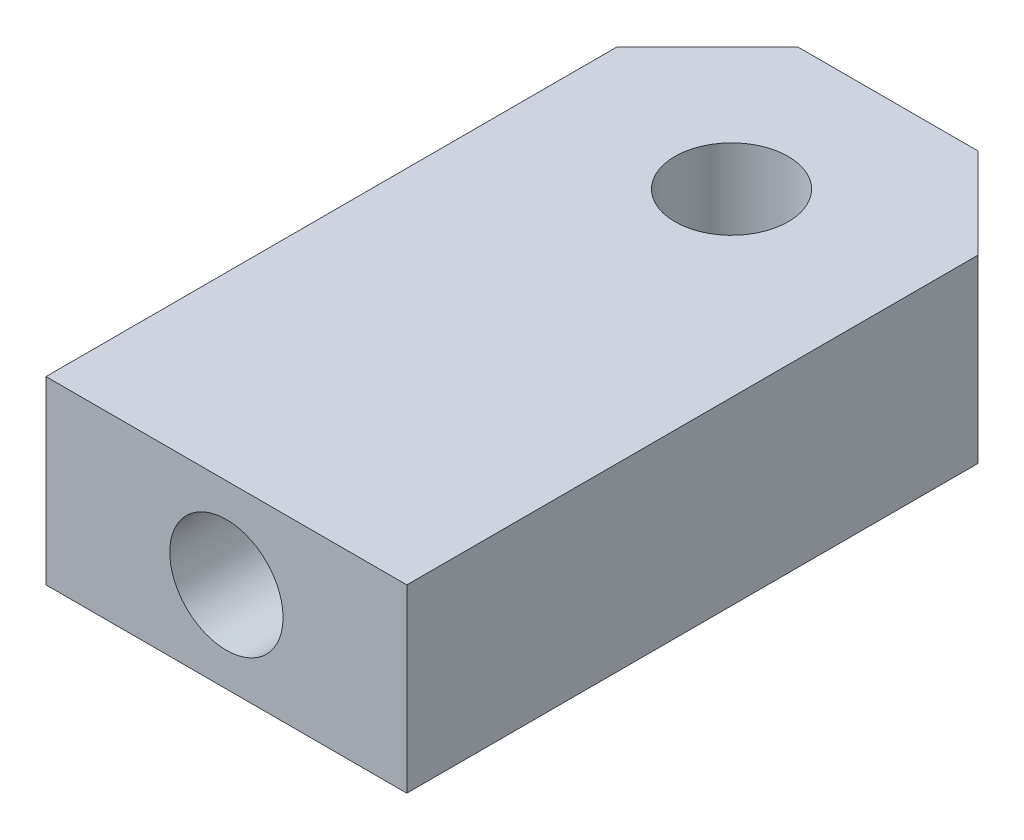
ISO-10303-21;
HEADER;
FILE_DESCRIPTION(('STEP AP214'),'2;1');
FILE_NAME('part.step','',(''),(''),'','','');
FILE_SCHEMA(('AUTOMOTIVE_DESIGN { 1 0 10303 214 1 1 1 1 }'));
ENDSEC;
DATA;
#1=APPLICATION_CONTEXT('core data for automotive mechanical design processes');
#2=APPLICATION_PROTOCOL_DEFINITION('international standard','automotive_design',2000,#1);
#3=PRODUCT_CONTEXT('',#1,'mechanical');
#4=PRODUCT('Part','Part','',(#3));
#5=PRODUCT_RELATED_PRODUCT_CATEGORY('part','',(#4));
#6=PRODUCT_DEFINITION_FORMATION('','',#4);
#7=PRODUCT_DEFINITION_CONTEXT('part definition',#1,'design');
#8=PRODUCT_DEFINITION('design','',#6,#7);
#9=PRODUCT_DEFINITION_SHAPE('','',#8);
#10=(LENGTH_UNIT() NAMED_UNIT(*) SI_UNIT(.MILLI.,.METRE.));
#11=(NAMED_UNIT(*) PLANE_ANGLE_UNIT() SI_UNIT($,.RADIAN.));
#12=(NAMED_UNIT(*) SI_UNIT($,.STERADIAN.) SOLID_ANGLE_UNIT());
#13=UNCERTAINTY_MEASURE_WITH_UNIT(LENGTH_MEASURE(1.E-05),#10,'distance_accuracy_value','');
#14=(GEOMETRIC_REPRESENTATION_CONTEXT(3) GLOBAL_UNCERTAINTY_ASSIGNED_CONTEXT((#13)) GLOBAL_UNIT_ASSIGNED_CONTEXT((#10,
#11,#12)) REPRESENTATION_CONTEXT('',''));
#15=CARTESIAN_POINT('',(0.,0.,0.));
#16=DIRECTION('',(0.,0.,1.));
#17=DIRECTION('',(1.,0.,0.));
#18=AXIS2_PLACEMENT_3D('',#15,#16,#17);
#19=CARTESIAN_POINT('',(5.,5.,0.));
#20=DIRECTION('',(-1.,0.,0.));
#21=DIRECTION('',(0.,0.,1.));
#22=AXIS2_PLACEMENT_3D('',#19,#20,#21);
#23=PLANE('',#22);
#24=DIRECTION('',(0.,0.,-1.));
#25=VECTOR('',#24,1.);
#26=CARTESIAN_POINT('',(5.,0.,0.));
#27=LINE('',#26,#25);
#28=CARTESIAN_POINT('',(5.,0.,14.));
#29=VERTEX_POINT('',#28);
#30=CARTESIAN_POINT('',(5.00000000000001,0.,-1.83012701892217));
#31=VERTEX_POINT('',#30);
#32=EDGE_CURVE('E122',#29,#31,#27,.T.);
#33=ORIENTED_EDGE('',*,*,#32,.T.);
#34=DIRECTION('',(0.,-1.,0.));
#35=VECTOR('',#34,1.);
#36=CARTESIAN_POINT('',(5.00000000000001,5.,-1.83012701892217));
#37=LINE('',#36,#35);
#38=CARTESIAN_POINT('',(5.00000000000001,5.,-1.83012701892217));
#39=VERTEX_POINT('',#38);
#40=EDGE_CURVE('E11',#39,#31,#37,.T.);
#41=ORIENTED_EDGE('',*,*,#40,.F.);
#42=DIRECTION('',(0.,0.,-1.));
#43=VECTOR('',#42,1.);
#44=CARTESIAN_POINT('',(5.,5.,0.));
#45=LINE('',#44,#43);
#46=CARTESIAN_POINT('',(5.,5.,14.));
#47=VERTEX_POINT('',#46);
#48=EDGE_CURVE('E84',#47,#39,#45,.T.);
#49=ORIENTED_EDGE('',*,*,#48,.F.);
#50=DIRECTION('',(0.,-1.,0.));
#51=VECTOR('',#50,1.);
#52=CARTESIAN_POINT('',(5.,5.,14.));
#53=LINE('',#52,#51);
#54=EDGE_CURVE('E118',#47,#29,#53,.T.);
#55=ORIENTED_EDGE('',*,*,#54,.T.);
#56=EDGE_LOOP('',(#33,#41,#49,#55));
#57=FACE_BOUND('',#56,.T.);
#58=ADVANCED_FACE('F34',(#57),#23,.F.);
#59=CARTESIAN_POINT('',(3.4150635094611,5.,-3.41506350946108));
#60=DIRECTION('',(0.707106781186549,0.,-0.707106781186546));
#61=DIRECTION('',(-0.707106781186546,0.,-0.707106781186549));
#62=AXIS2_PLACEMENT_3D('',#59,#60,#61);
#63=PLANE('',#62);
#64=DIRECTION('',(0.707106781186546,0.,0.707106781186549));
#65=VECTOR('',#64,1.);
#66=CARTESIAN_POINT('',(3.4150635094611,0.,-3.41506350946108));
#67=LINE('',#66,#65);
#68=CARTESIAN_POINT('',(2.49999999999998,0.,-4.33012701892221));
#69=VERTEX_POINT('',#68);
#70=EDGE_CURVE('E126',#69,#31,#67,.T.);
#71=ORIENTED_EDGE('',*,*,#70,.F.);
#72=DIRECTION('',(0.,-1.,0.));
#73=VECTOR('',#72,1.);
#74=CARTESIAN_POINT('',(2.49999999999998,5.,-4.33012701892221));
#75=LINE('',#74,#73);
#76=CARTESIAN_POINT('',(2.49999999999998,5.,-4.33012701892221));
#77=VERTEX_POINT('',#76);
#78=EDGE_CURVE('E43',#77,#69,#75,.T.);
#79=ORIENTED_EDGE('',*,*,#78,.F.);
#80=DIRECTION('',(0.707106781186546,0.,0.707106781186549));
#81=VECTOR('',#80,1.);
#82=CARTESIAN_POINT('',(3.4150635094611,5.,-3.41506350946108));
#83=LINE('',#82,#81);
#84=EDGE_CURVE('E113',#77,#39,#83,.T.);
#85=ORIENTED_EDGE('',*,*,#84,.T.);
#86=ORIENTED_EDGE('',*,*,#40,.T.);
#87=EDGE_LOOP('',(#71,#79,#85,#86));
#88=FACE_BOUND('',#87,.T.);
#89=ADVANCED_FACE('F144',(#88),#63,.T.);
#90=CARTESIAN_POINT('',(0.,5.,-4.33012701892221));
#91=DIRECTION('',(0.,0.,-1.));
#92=DIRECTION('',(-1.,0.,0.));
#93=AXIS2_PLACEMENT_3D('',#90,#91,#92);
#94=PLANE('',#93);
#95=DIRECTION('',(1.,0.,0.));
#96=VECTOR('',#95,1.);
#97=CARTESIAN_POINT('',(0.,0.,-4.33012701892221));
#98=LINE('',#97,#96);
#99=CARTESIAN_POINT('',(-2.49999999999997,0.,-4.33012701892221));
#100=VERTEX_POINT('',#99);
#101=EDGE_CURVE('E129',#100,#69,#98,.T.);
#102=ORIENTED_EDGE('',*,*,#101,.F.);
#103=DIRECTION('',(0.,-1.,0.));
#104=VECTOR('',#103,1.);
#105=CARTESIAN_POINT('',(-2.49999999999997,5.,-4.33012701892221));
#106=LINE('',#105,#104);
#107=CARTESIAN_POINT('',(-2.49999999999997,5.,-4.33012701892221));
#108=VERTEX_POINT('',#107);
#109=EDGE_CURVE('E102',#108,#100,#106,.T.);
#110=ORIENTED_EDGE('',*,*,#109,.F.);
#111=DIRECTION('',(1.,0.,0.));
#112=VECTOR('',#111,1.);
#113=CARTESIAN_POINT('',(0.,5.,-4.33012701892221));
#114=LINE('',#113,#112);
#115=EDGE_CURVE('E111',#108,#77,#114,.T.);
#116=ORIENTED_EDGE('',*,*,#115,.T.);
#117=ORIENTED_EDGE('',*,*,#78,.T.);
#118=EDGE_LOOP('',(#102,#110,#116,#117));
#119=FACE_BOUND('',#118,.T.);
#120=ADVANCED_FACE('F141',(#119),#94,.T.);
#121=CARTESIAN_POINT('',(-3.4150635094611,5.,-3.41506350946108));
#122=DIRECTION('',(-0.70710678118655,0.,-0.707106781186545));
#123=DIRECTION('',(-0.707106781186545,0.,0.70710678118655));
#124=AXIS2_PLACEMENT_3D('',#121,#122,#123);
#125=PLANE('',#124);
#126=DIRECTION('',(0.707106781186545,0.,-0.70710678118655));
#127=VECTOR('',#126,1.);
#128=CARTESIAN_POINT('',(-3.4150635094611,0.,-3.41506350946108));
#129=LINE('',#128,#127);
#130=CARTESIAN_POINT('',(-5.,0.,-1.83012701892217));
#131=VERTEX_POINT('',#130);
#132=EDGE_CURVE('E101',#131,#100,#129,.T.);
#133=ORIENTED_EDGE('',*,*,#132,.F.);
#134=DIRECTION('',(0.,-1.,0.));
#135=VECTOR('',#134,1.);
#136=CARTESIAN_POINT('',(-5.,5.,-1.83012701892217));
#137=LINE('',#136,#135);
#138=CARTESIAN_POINT('',(-5.,5.,-1.83012701892217));
#139=VERTEX_POINT('',#138);
#140=EDGE_CURVE('E95',#139,#131,#137,.T.);
#141=ORIENTED_EDGE('',*,*,#140,.F.);
#142=DIRECTION('',(0.707106781186545,0.,-0.70710678118655));
#143=VECTOR('',#142,1.);
#144=CARTESIAN_POINT('',(-3.4150635094611,5.,-3.41506350946108));
#145=LINE('',#144,#143);
#146=EDGE_CURVE('E99',#139,#108,#145,.T.);
#147=ORIENTED_EDGE('',*,*,#146,.T.);
#148=ORIENTED_EDGE('',*,*,#109,.T.);
#149=EDGE_LOOP('',(#133,#141,#147,#148));
#150=FACE_BOUND('',#149,.T.);
#151=ADVANCED_FACE('F97',(#150),#125,.T.);
#152=CARTESIAN_POINT('',(-5.,5.,0.));
#153=DIRECTION('',(1.,0.,0.));
#154=DIRECTION('',(0.,0.,-1.));
#155=AXIS2_PLACEMENT_3D('',#152,#153,#154);
#156=PLANE('',#155);
#157=DIRECTION('',(0.,0.,1.));
#158=VECTOR('',#157,1.);
#159=CARTESIAN_POINT('',(-5.,0.,0.));
#160=LINE('',#159,#158);
#161=CARTESIAN_POINT('',(-5.,0.,14.));
#162=VERTEX_POINT('',#161);
#163=EDGE_CURVE('E72',#131,#162,#160,.T.);
#164=ORIENTED_EDGE('',*,*,#163,.T.);
#165=DIRECTION('',(0.,-1.,0.));
#166=VECTOR('',#165,1.);
#167=CARTESIAN_POINT('',(-5.,5.,14.));
#168=LINE('',#167,#166);
#169=CARTESIAN_POINT('',(-5.,5.,14.));
#170=VERTEX_POINT('',#169);
#171=EDGE_CURVE('E103',#170,#162,#168,.T.);
#172=ORIENTED_EDGE('',*,*,#171,.F.);
#173=DIRECTION('',(0.,0.,1.));
#174=VECTOR('',#173,1.);
#175=CARTESIAN_POINT('',(-5.,5.,0.));
#176=LINE('',#175,#174);
#177=EDGE_CURVE('E105',#139,#170,#176,.T.);
#178=ORIENTED_EDGE('',*,*,#177,.F.);
#179=ORIENTED_EDGE('',*,*,#140,.T.);
#180=EDGE_LOOP('',(#164,#172,#178,#179));
#181=FACE_BOUND('',#180,.T.);
#182=ADVANCED_FACE('F106',(#181),#156,.F.);
#183=CARTESIAN_POINT('',(0.,5.,0.));
#184=DIRECTION('',(0.,-1.,0.));
#185=DIRECTION('',(0.,0.,-1.));
#186=AXIS2_PLACEMENT_3D('',#183,#184,#185);
#187=CYLINDRICAL_SURFACE('',#186,1.57);
#188=CARTESIAN_POINT('',(0.,5.,0.));
#189=DIRECTION('',(0.,1.,0.));
#190=DIRECTION('',(0.,0.,1.));
#191=AXIS2_PLACEMENT_3D('',#188,#189,#190);
#192=CIRCLE('',#191,1.57);
#193=CARTESIAN_POINT('',(0.,5.,1.57));
#194=VERTEX_POINT('',#193);
#195=EDGE_CURVE('E135',#194,#194,#192,.T.);
#196=ORIENTED_EDGE('',*,*,#195,.T.);
#197=EDGE_LOOP('',(#196));
#198=FACE_BOUND('',#197,.T.);
#199=CARTESIAN_POINT('',(0.,0.,0.));
#200=DIRECTION('',(0.,1.,0.));
#201=DIRECTION('',(0.,0.,1.));
#202=AXIS2_PLACEMENT_3D('',#199,#200,#201);
#203=CIRCLE('',#202,1.57);
#204=CARTESIAN_POINT('',(0.,0.,1.57));
#205=VERTEX_POINT('',#204);
#206=EDGE_CURVE('E119',#205,#205,#203,.T.);
#207=ORIENTED_EDGE('',*,*,#206,.F.);
#208=EDGE_LOOP('',(#207));
#209=FACE_BOUND('',#208,.T.);
#210=ADVANCED_FACE('F36',(#198,#209),#187,.F.);
#211=CARTESIAN_POINT('',(0.,5.,14.));
#212=DIRECTION('',(0.,0.,-1.));
#213=DIRECTION('',(-1.,0.,0.));
#214=AXIS2_PLACEMENT_3D('',#211,#212,#213);
#215=PLANE('',#214);
#216=CARTESIAN_POINT('',(0.,2.5,14.));
#217=DIRECTION('',(0.,0.,1.));
#218=DIRECTION('',(1.,0.,0.));
#219=AXIS2_PLACEMENT_3D('',#216,#217,#218);
#220=CIRCLE('',#219,1.57);
#221=CARTESIAN_POINT('',(1.57,2.5,14.));
#222=VERTEX_POINT('',#221);
#223=EDGE_CURVE('E225',#222,#222,#220,.T.);
#224=ORIENTED_EDGE('',*,*,#223,.F.);
#225=EDGE_LOOP('',(#224));
#226=FACE_BOUND('',#225,.T.);
#227=DIRECTION('',(1.,0.,0.));
#228=VECTOR('',#227,1.);
#229=CARTESIAN_POINT('',(0.,0.,14.));
#230=LINE('',#229,#228);
#231=EDGE_CURVE('E78',#162,#29,#230,.T.);
#232=ORIENTED_EDGE('',*,*,#231,.T.);
#233=ORIENTED_EDGE('',*,*,#54,.F.);
#234=DIRECTION('',(1.,0.,0.));
#235=VECTOR('',#234,1.);
#236=CARTESIAN_POINT('',(0.,5.,14.));
#237=LINE('',#236,#235);
#238=EDGE_CURVE('E51',#170,#47,#237,.T.);
#239=ORIENTED_EDGE('',*,*,#238,.F.);
#240=ORIENTED_EDGE('',*,*,#171,.T.);
#241=EDGE_LOOP('',(#232,#233,#239,#240));
#242=FACE_BOUND('',#241,.T.);
#243=ADVANCED_FACE('F149',(#226,#242),#215,.F.);
#244=CARTESIAN_POINT('',(0.,5.,0.));
#245=DIRECTION('',(0.,1.,0.));
#246=DIRECTION('',(0.,0.,1.));
#247=AXIS2_PLACEMENT_3D('',#244,#245,#246);
#248=PLANE('',#247);
#249=ORIENTED_EDGE('',*,*,#195,.F.);
#250=EDGE_LOOP('',(#249));
#251=FACE_BOUND('',#250,.T.);
#252=ORIENTED_EDGE('',*,*,#48,.T.);
#253=ORIENTED_EDGE('',*,*,#84,.F.);
#254=ORIENTED_EDGE('',*,*,#115,.F.);
#255=ORIENTED_EDGE('',*,*,#146,.F.);
#256=ORIENTED_EDGE('',*,*,#177,.T.);
#257=ORIENTED_EDGE('',*,*,#238,.T.);
#258=EDGE_LOOP('',(#252,#253,#254,#255,#256,#257));
#259=FACE_BOUND('',#258,.T.);
#260=ADVANCED_FACE('F109',(#251,#259),#248,.T.);
#261=CARTESIAN_POINT('',(0.,0.,0.));
#262=DIRECTION('',(0.,1.,0.));
#263=DIRECTION('',(0.,0.,1.));
#264=AXIS2_PLACEMENT_3D('',#261,#262,#263);
#265=PLANE('',#264);
#266=ORIENTED_EDGE('',*,*,#206,.T.);
#267=EDGE_LOOP('',(#266));
#268=FACE_BOUND('',#267,.T.);
#269=ORIENTED_EDGE('',*,*,#32,.F.);
#270=ORIENTED_EDGE('',*,*,#231,.F.);
#271=ORIENTED_EDGE('',*,*,#163,.F.);
#272=ORIENTED_EDGE('',*,*,#132,.T.);
#273=ORIENTED_EDGE('',*,*,#101,.T.);
#274=ORIENTED_EDGE('',*,*,#70,.T.);
#275=EDGE_LOOP('',(#269,#270,#271,#272,#273,#274));
#276=FACE_BOUND('',#275,.T.);
#277=ADVANCED_FACE('F147',(#268,#276),#265,.F.);
#278=CARTESIAN_POINT('',(0.,2.5,6.));
#279=DIRECTION('',(0.,0.,1.));
#280=DIRECTION('',(1.,0.,0.));
#281=AXIS2_PLACEMENT_3D('',#278,#279,#280);
#282=CYLINDRICAL_SURFACE('',#281,1.57);
#283=CARTESIAN_POINT('',(0.,2.5,6.));
#284=DIRECTION('',(0.,0.,1.));
#285=DIRECTION('',(1.,0.,0.));
#286=AXIS2_PLACEMENT_3D('',#283,#284,#285);
#287=CIRCLE('',#286,1.57);
#288=CARTESIAN_POINT('',(1.57,2.5,6.));
#289=VERTEX_POINT('',#288);
#290=EDGE_CURVE('E123',#289,#289,#287,.T.);
#291=ORIENTED_EDGE('',*,*,#290,.F.);
#292=EDGE_LOOP('',(#291));
#293=FACE_BOUND('',#292,.T.);
#294=ORIENTED_EDGE('',*,*,#223,.T.);
#295=EDGE_LOOP('',(#294));
#296=FACE_BOUND('',#295,.T.);
#297=ADVANCED_FACE('F196',(#293,#296),#282,.F.);
#298=CARTESIAN_POINT('',(0.,2.5,6.));
#299=DIRECTION('',(0.,0.,1.));
#300=DIRECTION('',(1.,0.,0.));
#301=AXIS2_PLACEMENT_3D('',#298,#299,#300);
#302=PLANE('',#301);
#303=ORIENTED_EDGE('',*,*,#290,.T.);
#304=EDGE_LOOP('',(#303));
#305=FACE_BOUND('',#304,.T.);
#306=ADVANCED_FACE('F209',(#305),#302,.T.);
#307=CLOSED_SHELL('',(#58,#89,#120,#151,#182,#210,#243,#260,#277,#297,#306));
#308=MANIFOLD_SOLID_BREP('B2',#307);
#309=ADVANCED_BREP_SHAPE_REPRESENTATION('',(#18,#308),#14);
#310=SHAPE_DEFINITION_REPRESENTATION(#9,#309);
ENDSEC;
END-ISO-10303-21;
